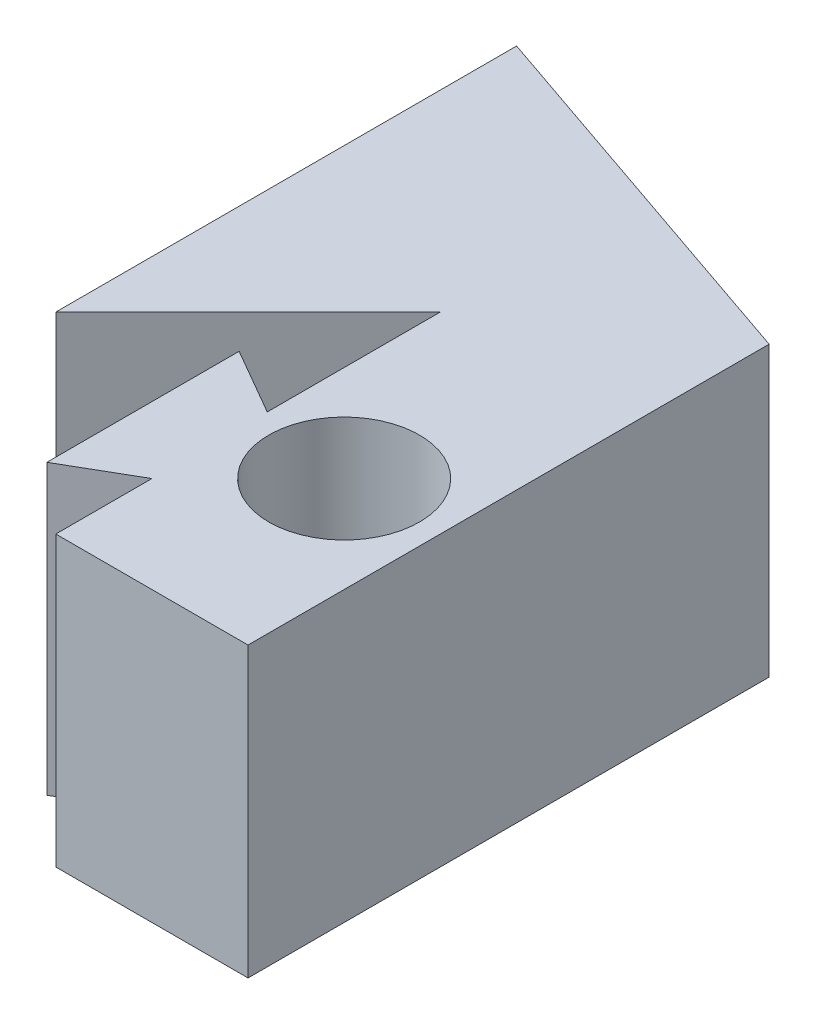
ISO-10303-21;
HEADER;
FILE_DESCRIPTION(('STEP AP214'),'2;1');
FILE_NAME('part.step','',(''),(''),'','','');
FILE_SCHEMA(('AUTOMOTIVE_DESIGN { 1 0 10303 214 1 1 1 1 }'));
ENDSEC;
DATA;
#1=APPLICATION_CONTEXT('core data for automotive mechanical design processes');
#2=APPLICATION_PROTOCOL_DEFINITION('international standard','automotive_design',2000,#1);
#3=PRODUCT_CONTEXT('',#1,'mechanical');
#4=PRODUCT('Part','Part','',(#3));
#5=PRODUCT_RELATED_PRODUCT_CATEGORY('part','',(#4));
#6=PRODUCT_DEFINITION_FORMATION('','',#4);
#7=PRODUCT_DEFINITION_CONTEXT('part definition',#1,'design');
#8=PRODUCT_DEFINITION('design','',#6,#7);
#9=PRODUCT_DEFINITION_SHAPE('','',#8);
#10=(LENGTH_UNIT() NAMED_UNIT(*) SI_UNIT(.MILLI.,.METRE.));
#11=(NAMED_UNIT(*) PLANE_ANGLE_UNIT() SI_UNIT($,.RADIAN.));
#12=(NAMED_UNIT(*) SI_UNIT($,.STERADIAN.) SOLID_ANGLE_UNIT());
#13=UNCERTAINTY_MEASURE_WITH_UNIT(LENGTH_MEASURE(1.E-05),#10,'distance_accuracy_value','');
#14=(GEOMETRIC_REPRESENTATION_CONTEXT(3) GLOBAL_UNCERTAINTY_ASSIGNED_CONTEXT((#13)) GLOBAL_UNIT_ASSIGNED_CONTEXT((#10,
#11,#12)) REPRESENTATION_CONTEXT('',''));
#15=CARTESIAN_POINT('',(0.,0.,0.));
#16=DIRECTION('',(0.,0.,1.));
#17=DIRECTION('',(1.,0.,0.));
#18=AXIS2_PLACEMENT_3D('',#15,#16,#17);
#19=CARTESIAN_POINT('',(6.35,9.525,-6.35000000000001));
#20=DIRECTION('',(0.,1.,0.));
#21=DIRECTION('',(0.,0.,1.));
#22=AXIS2_PLACEMENT_3D('',#19,#20,#21);
#23=PLANE('',#22);
#24=CARTESIAN_POINT('',(6.35,9.525,-6.35000000000001));
#25=DIRECTION('',(0.,1.,0.));
#26=DIRECTION('',(0.,0.,1.));
#27=AXIS2_PLACEMENT_3D('',#24,#25,#26);
#28=CIRCLE('',#27,2.4892);
#29=CARTESIAN_POINT('',(6.35,9.525,-3.86080000000001));
#30=VERTEX_POINT('',#29);
#31=EDGE_CURVE('E243',#30,#30,#28,.T.);
#32=ORIENTED_EDGE('',*,*,#31,.F.);
#33=EDGE_LOOP('',(#32));
#34=FACE_BOUND('',#33,.T.);
#35=DIRECTION('',(0.866025403784439,0.,-0.499999999999999));
#36=VECTOR('',#35,1.);
#37=CARTESIAN_POINT('',(-0.581065328507795,9.525,-1.0064346714922));
#38=LINE('',#37,#36);
#39=CARTESIAN_POINT('',(0.975295474387534,9.525,-1.905));
#40=VERTEX_POINT('',#39);
#41=CARTESIAN_POINT('',(3.17500000000001,9.525,-3.175));
#42=VERTEX_POINT('',#41);
#43=EDGE_CURVE('E167',#40,#42,#38,.T.);
#44=ORIENTED_EDGE('',*,*,#43,.T.);
#45=DIRECTION('',(0.,0.,1.));
#46=VECTOR('',#45,1.);
#47=CARTESIAN_POINT('',(3.17500000000001,9.525,0.));
#48=LINE('',#47,#46);
#49=CARTESIAN_POINT('',(3.17500000000001,9.525,0.));
#50=VERTEX_POINT('',#49);
#51=EDGE_CURVE('E213',#42,#50,#48,.T.);
#52=ORIENTED_EDGE('',*,*,#51,.T.);
#53=DIRECTION('',(-1.,0.,0.));
#54=VECTOR('',#53,1.);
#55=CARTESIAN_POINT('',(0.,9.525,0.));
#56=LINE('',#55,#54);
#57=CARTESIAN_POINT('',(9.525,9.525,0.));
#58=VERTEX_POINT('',#57);
#59=EDGE_CURVE('E158',#58,#50,#56,.T.);
#60=ORIENTED_EDGE('',*,*,#59,.F.);
#61=DIRECTION('',(0.,0.,1.));
#62=VECTOR('',#61,1.);
#63=CARTESIAN_POINT('',(9.525,9.525,0.));
#64=LINE('',#63,#62);
#65=CARTESIAN_POINT('',(9.52500000000006,9.525,-17.212483646232));
#66=VERTEX_POINT('',#65);
#67=EDGE_CURVE('E147',#66,#58,#64,.T.);
#68=ORIENTED_EDGE('',*,*,#67,.F.);
#69=DIRECTION('',(-0.945844813607445,0.,-0.32461914387771));
#70=VECTOR('',#69,1.);
#71=CARTESIAN_POINT('',(9.52500000000006,9.525,-17.212483646232));
#72=LINE('',#71,#70);
#73=CARTESIAN_POINT('',(-3.17499999999995,9.525,-21.5711935190738));
#74=VERTEX_POINT('',#73);
#75=EDGE_CURVE('E255',#66,#74,#72,.T.);
#76=ORIENTED_EDGE('',*,*,#75,.T.);
#77=DIRECTION('',(0.,0.,1.));
#78=VECTOR('',#77,1.);
#79=CARTESIAN_POINT('',(-3.175,9.525,-12.7));
#80=LINE('',#79,#78);
#81=CARTESIAN_POINT('',(-3.175,9.525,-6.35000000000001));
#82=VERTEX_POINT('',#81);
#83=EDGE_CURVE('E228',#74,#82,#80,.T.);
#84=ORIENTED_EDGE('',*,*,#83,.T.);
#85=DIRECTION('',(0.707106781186548,0.,-0.707106781186547));
#86=VECTOR('',#85,1.);
#87=CARTESIAN_POINT('',(-4.7625,9.525,-4.76250000000001));
#88=LINE('',#87,#86);
#89=CARTESIAN_POINT('',(3.17499999999999,9.525,-12.7));
#90=VERTEX_POINT('',#89);
#91=EDGE_CURVE('E240',#82,#90,#88,.T.);
#92=ORIENTED_EDGE('',*,*,#91,.T.);
#93=DIRECTION('',(0.,0.,1.));
#94=VECTOR('',#93,1.);
#95=CARTESIAN_POINT('',(3.17500000000003,9.525,0.));
#96=LINE('',#95,#94);
#97=CARTESIAN_POINT('',(3.17500000000001,9.525,-6.985));
#98=VERTEX_POINT('',#97);
#99=EDGE_CURVE('E196',#90,#98,#96,.T.);
#100=ORIENTED_EDGE('',*,*,#99,.T.);
#101=DIRECTION('',(-0.866025403784438,0.,-0.500000000000001));
#102=VECTOR('',#101,1.);
#103=CARTESIAN_POINT('',(3.81834372271716,9.525,-6.6135653285078));
#104=LINE('',#103,#102);
#105=CARTESIAN_POINT('',(0.975295474387533,9.525,-8.255));
#106=VERTEX_POINT('',#105);
#107=EDGE_CURVE('E221',#98,#106,#104,.T.);
#108=ORIENTED_EDGE('',*,*,#107,.T.);
#109=DIRECTION('',(0.,0.,1.));
#110=VECTOR('',#109,1.);
#111=CARTESIAN_POINT('',(0.975295474387535,9.525,0.));
#112=LINE('',#111,#110);
#113=EDGE_CURVE('E177',#106,#40,#112,.T.);
#114=ORIENTED_EDGE('',*,*,#113,.T.);
#115=EDGE_LOOP('',(#44,#52,#60,#68,#76,#84,#92,#100,#108,#114));
#116=FACE_BOUND('',#115,.T.);
#117=ADVANCED_FACE('F74',(#34,#116),#23,.T.);
#118=CARTESIAN_POINT('',(-0.581065328507795,-15.3097174198376,-1.0064346714922));
#119=DIRECTION('',(0.499999999999999,0.,0.866025403784439));
#120=DIRECTION('',(0.866025403784439,0.,-0.499999999999999));
#121=AXIS2_PLACEMENT_3D('',#118,#119,#120);
#122=PLANE('',#121);
#123=DIRECTION('',(-0.866025403784439,0.,0.499999999999999));
#124=VECTOR('',#123,1.);
#125=CARTESIAN_POINT('',(-0.581065328507795,0.,-1.0064346714922));
#126=LINE('',#125,#124);
#127=CARTESIAN_POINT('',(3.17500000000001,0.,-3.175));
#128=VERTEX_POINT('',#127);
#129=CARTESIAN_POINT('',(0.975295474387534,0.,-1.905));
#130=VERTEX_POINT('',#129);
#131=EDGE_CURVE('E121',#128,#130,#126,.T.);
#132=ORIENTED_EDGE('',*,*,#131,.F.);
#133=DIRECTION('',(0.,1.,0.));
#134=VECTOR('',#133,1.);
#135=CARTESIAN_POINT('',(3.17500000000001,-15.3097174198376,-3.175));
#136=LINE('',#135,#134);
#137=EDGE_CURVE('E168',#128,#42,#136,.T.);
#138=ORIENTED_EDGE('',*,*,#137,.T.);
#139=ORIENTED_EDGE('',*,*,#43,.F.);
#140=DIRECTION('',(0.,1.,0.));
#141=VECTOR('',#140,1.);
#142=CARTESIAN_POINT('',(0.975295474387534,-15.3097174198376,-1.905));
#143=LINE('',#142,#141);
#144=EDGE_CURVE('E172',#130,#40,#143,.T.);
#145=ORIENTED_EDGE('',*,*,#144,.F.);
#146=EDGE_LOOP('',(#132,#138,#139,#145));
#147=FACE_BOUND('',#146,.T.);
#148=ADVANCED_FACE('F291',(#147),#122,.T.);
#149=CARTESIAN_POINT('',(0.975295474387535,-15.3097174198376,0.));
#150=DIRECTION('',(-1.,0.,0.));
#151=DIRECTION('',(0.,0.,1.));
#152=AXIS2_PLACEMENT_3D('',#149,#150,#151);
#153=PLANE('',#152);
#154=DIRECTION('',(0.,0.,-1.));
#155=VECTOR('',#154,1.);
#156=CARTESIAN_POINT('',(0.975295474387535,0.,0.));
#157=LINE('',#156,#155);
#158=CARTESIAN_POINT('',(0.975295474387533,0.,-8.255));
#159=VERTEX_POINT('',#158);
#160=EDGE_CURVE('E176',#130,#159,#157,.T.);
#161=ORIENTED_EDGE('',*,*,#160,.F.);
#162=ORIENTED_EDGE('',*,*,#144,.T.);
#163=ORIENTED_EDGE('',*,*,#113,.F.);
#164=DIRECTION('',(0.,1.,0.));
#165=VECTOR('',#164,1.);
#166=CARTESIAN_POINT('',(0.975295474387533,-15.3097174198376,-8.255));
#167=LINE('',#166,#165);
#168=EDGE_CURVE('E203',#159,#106,#167,.T.);
#169=ORIENTED_EDGE('',*,*,#168,.F.);
#170=EDGE_LOOP('',(#161,#162,#163,#169));
#171=FACE_BOUND('',#170,.T.);
#172=ADVANCED_FACE('F287',(#171),#153,.T.);
#173=CARTESIAN_POINT('',(3.81834372271716,-15.3097174198376,-6.6135653285078));
#174=DIRECTION('',(0.5,0.,-0.866025403784438));
#175=DIRECTION('',(-0.866025403784438,0.,-0.500000000000001));
#176=AXIS2_PLACEMENT_3D('',#173,#174,#175);
#177=PLANE('',#176);
#178=DIRECTION('',(0.866025403784438,0.,0.500000000000001));
#179=VECTOR('',#178,1.);
#180=CARTESIAN_POINT('',(3.81834372271716,0.,-6.6135653285078));
#181=LINE('',#180,#179);
#182=CARTESIAN_POINT('',(3.17500000000001,0.,-6.985));
#183=VERTEX_POINT('',#182);
#184=EDGE_CURVE('E131',#159,#183,#181,.T.);
#185=ORIENTED_EDGE('',*,*,#184,.F.);
#186=ORIENTED_EDGE('',*,*,#168,.T.);
#187=ORIENTED_EDGE('',*,*,#107,.F.);
#188=DIRECTION('',(0.,1.,0.));
#189=VECTOR('',#188,1.);
#190=CARTESIAN_POINT('',(3.17500000000001,-15.3097174198376,-6.985));
#191=LINE('',#190,#189);
#192=EDGE_CURVE('E201',#183,#98,#191,.T.);
#193=ORIENTED_EDGE('',*,*,#192,.F.);
#194=EDGE_LOOP('',(#185,#186,#187,#193));
#195=FACE_BOUND('',#194,.T.);
#196=ADVANCED_FACE('F313',(#195),#177,.T.);
#197=CARTESIAN_POINT('',(3.17500000000003,-15.3097174198376,0.));
#198=DIRECTION('',(-1.,0.,0.));
#199=DIRECTION('',(0.,0.,1.));
#200=AXIS2_PLACEMENT_3D('',#197,#198,#199);
#201=PLANE('',#200);
#202=DIRECTION('',(0.,0.,-1.));
#203=VECTOR('',#202,1.);
#204=CARTESIAN_POINT('',(3.17500000000003,0.,0.));
#205=LINE('',#204,#203);
#206=CARTESIAN_POINT('',(3.17499999999999,0.,-12.7));
#207=VERTEX_POINT('',#206);
#208=EDGE_CURVE('E85',#183,#207,#205,.T.);
#209=ORIENTED_EDGE('',*,*,#208,.F.);
#210=ORIENTED_EDGE('',*,*,#192,.T.);
#211=ORIENTED_EDGE('',*,*,#99,.F.);
#212=DIRECTION('',(0.,1.,0.));
#213=VECTOR('',#212,1.);
#214=CARTESIAN_POINT('',(3.17499999999999,-15.3097174198376,-12.7));
#215=LINE('',#214,#213);
#216=EDGE_CURVE('E148',#207,#90,#215,.T.);
#217=ORIENTED_EDGE('',*,*,#216,.F.);
#218=EDGE_LOOP('',(#209,#210,#211,#217));
#219=FACE_BOUND('',#218,.T.);
#220=ADVANCED_FACE('F194',(#219),#201,.T.);
#221=CARTESIAN_POINT('',(9.525,-15.3097174198376,0.));
#222=DIRECTION('',(-1.,0.,0.));
#223=DIRECTION('',(0.,0.,1.));
#224=AXIS2_PLACEMENT_3D('',#221,#222,#223);
#225=PLANE('',#224);
#226=DIRECTION('',(0.,1.,0.));
#227=VECTOR('',#226,1.);
#228=CARTESIAN_POINT('',(9.525,-15.3097174198376,0.));
#229=LINE('',#228,#227);
#230=CARTESIAN_POINT('',(9.525,0.,0.));
#231=VERTEX_POINT('',#230);
#232=EDGE_CURVE('E151',#231,#58,#229,.T.);
#233=ORIENTED_EDGE('',*,*,#232,.F.);
#234=DIRECTION('',(0.,0.,-1.));
#235=VECTOR('',#234,1.);
#236=CARTESIAN_POINT('',(9.525,0.,0.));
#237=LINE('',#236,#235);
#238=CARTESIAN_POINT('',(9.52500000000006,0.,-17.212483646232));
#239=VERTEX_POINT('',#238);
#240=EDGE_CURVE('E136',#231,#239,#237,.T.);
#241=ORIENTED_EDGE('',*,*,#240,.T.);
#242=DIRECTION('',(0.,1.,0.));
#243=VECTOR('',#242,1.);
#244=CARTESIAN_POINT('',(9.52500000000006,-14.8009507435979,-17.212483646232));
#245=LINE('',#244,#243);
#246=EDGE_CURVE('E251',#239,#66,#245,.T.);
#247=ORIENTED_EDGE('',*,*,#246,.T.);
#248=ORIENTED_EDGE('',*,*,#67,.T.);
#249=EDGE_LOOP('',(#233,#241,#247,#248));
#250=FACE_BOUND('',#249,.T.);
#251=ADVANCED_FACE('F155',(#250),#225,.F.);
#252=CARTESIAN_POINT('',(0.,-15.3097174198376,0.));
#253=DIRECTION('',(0.,0.,-1.));
#254=DIRECTION('',(-1.,0.,0.));
#255=AXIS2_PLACEMENT_3D('',#252,#253,#254);
#256=PLANE('',#255);
#257=DIRECTION('',(0.,1.,0.));
#258=VECTOR('',#257,1.);
#259=CARTESIAN_POINT('',(3.17500000000001,-15.3097174198376,0.));
#260=LINE('',#259,#258);
#261=CARTESIAN_POINT('',(3.17500000000001,0.,0.));
#262=VERTEX_POINT('',#261);
#263=EDGE_CURVE('E116',#262,#50,#260,.T.);
#264=ORIENTED_EDGE('',*,*,#263,.F.);
#265=DIRECTION('',(1.,0.,0.));
#266=VECTOR('',#265,1.);
#267=CARTESIAN_POINT('',(0.,0.,0.));
#268=LINE('',#267,#266);
#269=EDGE_CURVE('E78',#262,#231,#268,.T.);
#270=ORIENTED_EDGE('',*,*,#269,.T.);
#271=ORIENTED_EDGE('',*,*,#232,.T.);
#272=ORIENTED_EDGE('',*,*,#59,.T.);
#273=EDGE_LOOP('',(#264,#270,#271,#272));
#274=FACE_BOUND('',#273,.T.);
#275=ADVANCED_FACE('F150',(#274),#256,.F.);
#276=CARTESIAN_POINT('',(3.17500000000001,-15.3097174198376,0.));
#277=DIRECTION('',(-1.,0.,0.));
#278=DIRECTION('',(0.,0.,1.));
#279=AXIS2_PLACEMENT_3D('',#276,#277,#278);
#280=PLANE('',#279);
#281=DIRECTION('',(0.,0.,-1.));
#282=VECTOR('',#281,1.);
#283=CARTESIAN_POINT('',(3.17500000000001,0.,0.));
#284=LINE('',#283,#282);
#285=EDGE_CURVE('E12',#262,#128,#284,.T.);
#286=ORIENTED_EDGE('',*,*,#285,.F.);
#287=ORIENTED_EDGE('',*,*,#263,.T.);
#288=ORIENTED_EDGE('',*,*,#51,.F.);
#289=ORIENTED_EDGE('',*,*,#137,.F.);
#290=EDGE_LOOP('',(#286,#287,#288,#289));
#291=FACE_BOUND('',#290,.T.);
#292=ADVANCED_FACE('F293',(#291),#280,.T.);
#293=CARTESIAN_POINT('',(6.35,0.,-6.35000000000001));
#294=DIRECTION('',(0.,1.,0.));
#295=DIRECTION('',(0.,0.,1.));
#296=AXIS2_PLACEMENT_3D('',#293,#294,#295);
#297=PLANE('',#296);
#298=CARTESIAN_POINT('',(6.35,0.,-6.35000000000001));
#299=DIRECTION('',(0.,1.,0.));
#300=DIRECTION('',(0.,0.,1.));
#301=AXIS2_PLACEMENT_3D('',#298,#299,#300);
#302=CIRCLE('',#301,2.4892);
#303=CARTESIAN_POINT('',(6.35,0.,-3.86080000000001));
#304=VERTEX_POINT('',#303);
#305=EDGE_CURVE('E247',#304,#304,#302,.T.);
#306=ORIENTED_EDGE('',*,*,#305,.T.);
#307=EDGE_LOOP('',(#306));
#308=FACE_BOUND('',#307,.T.);
#309=ORIENTED_EDGE('',*,*,#131,.T.);
#310=ORIENTED_EDGE('',*,*,#160,.T.);
#311=ORIENTED_EDGE('',*,*,#184,.T.);
#312=ORIENTED_EDGE('',*,*,#208,.T.);
#313=DIRECTION('',(-0.707106781186548,0.,0.707106781186547));
#314=VECTOR('',#313,1.);
#315=CARTESIAN_POINT('',(-4.7625,0.,-4.76250000000001));
#316=LINE('',#315,#314);
#317=CARTESIAN_POINT('',(-3.175,0.,-6.35000000000001));
#318=VERTEX_POINT('',#317);
#319=EDGE_CURVE('E187',#207,#318,#316,.T.);
#320=ORIENTED_EDGE('',*,*,#319,.T.);
#321=DIRECTION('',(0.,0.,-1.));
#322=VECTOR('',#321,1.);
#323=CARTESIAN_POINT('',(-3.175,0.,-12.7));
#324=LINE('',#323,#322);
#325=CARTESIAN_POINT('',(-3.17499999999996,0.,-21.5711935190738));
#326=VERTEX_POINT('',#325);
#327=EDGE_CURVE('E173',#318,#326,#324,.T.);
#328=ORIENTED_EDGE('',*,*,#327,.T.);
#329=DIRECTION('',(0.945844813607445,0.,0.32461914387771));
#330=VECTOR('',#329,1.);
#331=CARTESIAN_POINT('',(9.52500000000006,0.,-17.212483646232));
#332=LINE('',#331,#330);
#333=EDGE_CURVE('E141',#326,#239,#332,.T.);
#334=ORIENTED_EDGE('',*,*,#333,.T.);
#335=ORIENTED_EDGE('',*,*,#240,.F.);
#336=ORIENTED_EDGE('',*,*,#269,.F.);
#337=ORIENTED_EDGE('',*,*,#285,.T.);
#338=EDGE_LOOP('',(#309,#310,#311,#312,#320,#328,#334,#335,#336,#337));
#339=FACE_BOUND('',#338,.T.);
#340=ADVANCED_FACE('F76',(#308,#339),#297,.F.);
#341=CARTESIAN_POINT('',(-3.175,-12.7633420388235,-12.7));
#342=DIRECTION('',(-1.,0.,0.));
#343=DIRECTION('',(0.,0.,1.));
#344=AXIS2_PLACEMENT_3D('',#341,#342,#343);
#345=PLANE('',#344);
#346=ORIENTED_EDGE('',*,*,#327,.F.);
#347=DIRECTION('',(0.,1.,0.));
#348=VECTOR('',#347,1.);
#349=CARTESIAN_POINT('',(-3.175,-15.3097174198376,-6.35000000000001));
#350=LINE('',#349,#348);
#351=EDGE_CURVE('E236',#318,#82,#350,.T.);
#352=ORIENTED_EDGE('',*,*,#351,.T.);
#353=ORIENTED_EDGE('',*,*,#83,.F.);
#354=DIRECTION('',(0.,1.,0.));
#355=VECTOR('',#354,1.);
#356=CARTESIAN_POINT('',(-3.17499999999995,-14.8009507435979,-21.5711935190738));
#357=LINE('',#356,#355);
#358=EDGE_CURVE('E254',#326,#74,#357,.T.);
#359=ORIENTED_EDGE('',*,*,#358,.F.);
#360=EDGE_LOOP('',(#346,#352,#353,#359));
#361=FACE_BOUND('',#360,.T.);
#362=ADVANCED_FACE('F281',(#361),#345,.T.);
#363=CARTESIAN_POINT('',(-4.7625,-15.3097174198376,-4.76250000000001));
#364=DIRECTION('',(0.707106781186547,0.,0.707106781186548));
#365=DIRECTION('',(0.707106781186548,0.,-0.707106781186547));
#366=AXIS2_PLACEMENT_3D('',#363,#364,#365);
#367=PLANE('',#366);
#368=ORIENTED_EDGE('',*,*,#319,.F.);
#369=ORIENTED_EDGE('',*,*,#216,.T.);
#370=ORIENTED_EDGE('',*,*,#91,.F.);
#371=ORIENTED_EDGE('',*,*,#351,.F.);
#372=EDGE_LOOP('',(#368,#369,#370,#371));
#373=FACE_BOUND('',#372,.T.);
#374=ADVANCED_FACE('F282',(#373),#367,.T.);
#375=CARTESIAN_POINT('',(6.35,0.,-6.35000000000001));
#376=DIRECTION('',(0.,1.,0.));
#377=DIRECTION('',(0.,0.,1.));
#378=AXIS2_PLACEMENT_3D('',#375,#376,#377);
#379=CYLINDRICAL_SURFACE('',#378,2.4892);
#380=ORIENTED_EDGE('',*,*,#31,.T.);
#381=EDGE_LOOP('',(#380));
#382=FACE_BOUND('',#381,.T.);
#383=ORIENTED_EDGE('',*,*,#305,.F.);
#384=EDGE_LOOP('',(#383));
#385=FACE_BOUND('',#384,.T.);
#386=ADVANCED_FACE('F351',(#382,#385),#379,.F.);
#387=CARTESIAN_POINT('',(9.52500000000006,-14.8009507435979,-17.212483646232));
#388=DIRECTION('',(0.32461914387771,0.,-0.945844813607445));
#389=DIRECTION('',(-0.945844813607445,0.,-0.32461914387771));
#390=AXIS2_PLACEMENT_3D('',#387,#388,#389);
#391=PLANE('',#390);
#392=ORIENTED_EDGE('',*,*,#333,.F.);
#393=ORIENTED_EDGE('',*,*,#358,.T.);
#394=ORIENTED_EDGE('',*,*,#75,.F.);
#395=ORIENTED_EDGE('',*,*,#246,.F.);
#396=EDGE_LOOP('',(#392,#393,#394,#395));
#397=FACE_BOUND('',#396,.T.);
#398=ADVANCED_FACE('F271',(#397),#391,.T.);
#399=CLOSED_SHELL('',(#117,#148,#172,#196,#220,#251,#275,#292,#340,#362,#374,#386,#398));
#400=MANIFOLD_SOLID_BREP('B2',#399);
#401=ADVANCED_BREP_SHAPE_REPRESENTATION('',(#18,#400),#14);
#402=SHAPE_DEFINITION_REPRESENTATION(#9,#401);
ENDSEC;
END-ISO-10303-21;
